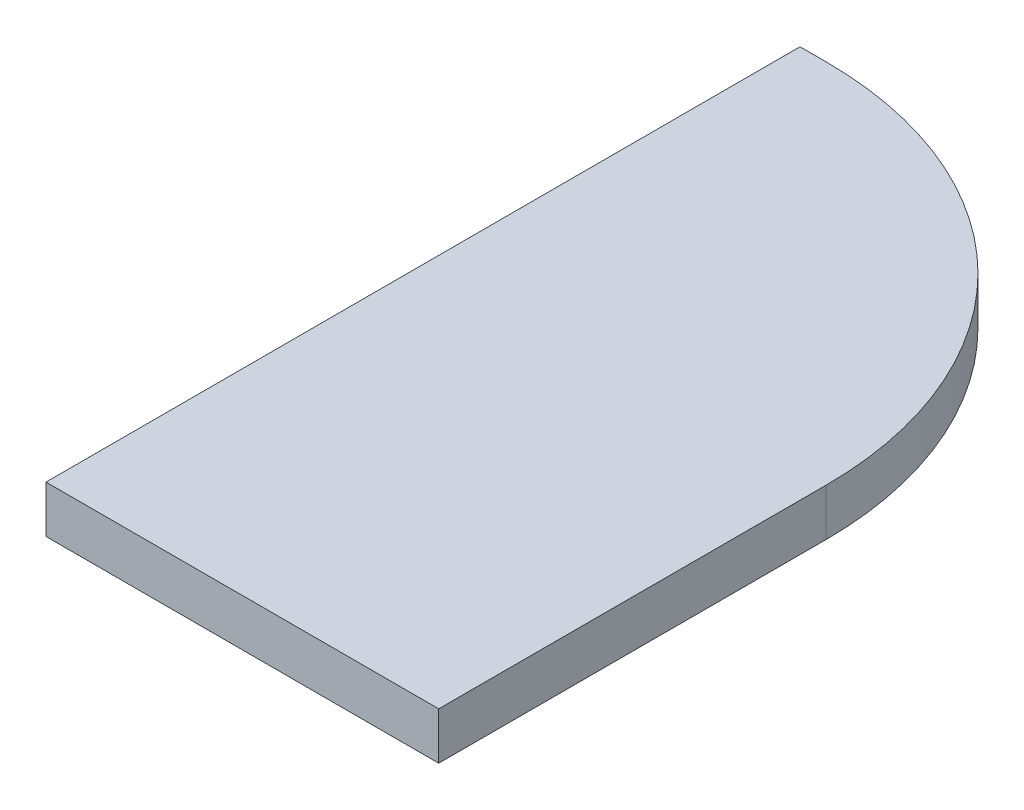
ISO-10303-21;
HEADER;
FILE_DESCRIPTION(('STEP AP214'),'2;1');
FILE_NAME('part.step','',(''),(''),'','','');
FILE_SCHEMA(('AUTOMOTIVE_DESIGN { 1 0 10303 214 1 1 1 1 }'));
ENDSEC;
DATA;
#1=APPLICATION_CONTEXT('core data for automotive mechanical design processes');
#2=APPLICATION_PROTOCOL_DEFINITION('international standard','automotive_design',2000,#1);
#3=PRODUCT_CONTEXT('',#1,'mechanical');
#4=PRODUCT('Part','Part','',(#3));
#5=PRODUCT_RELATED_PRODUCT_CATEGORY('part','',(#4));
#6=PRODUCT_DEFINITION_FORMATION('','',#4);
#7=PRODUCT_DEFINITION_CONTEXT('part definition',#1,'design');
#8=PRODUCT_DEFINITION('design','',#6,#7);
#9=PRODUCT_DEFINITION_SHAPE('','',#8);
#10=(LENGTH_UNIT() NAMED_UNIT(*) SI_UNIT(.MILLI.,.METRE.));
#11=(NAMED_UNIT(*) PLANE_ANGLE_UNIT() SI_UNIT($,.RADIAN.));
#12=(NAMED_UNIT(*) SI_UNIT($,.STERADIAN.) SOLID_ANGLE_UNIT());
#13=UNCERTAINTY_MEASURE_WITH_UNIT(LENGTH_MEASURE(1.E-05),#10,'distance_accuracy_value','');
#14=(GEOMETRIC_REPRESENTATION_CONTEXT(3) GLOBAL_UNCERTAINTY_ASSIGNED_CONTEXT((#13)) GLOBAL_UNIT_ASSIGNED_CONTEXT((#10,
#11,#12)) REPRESENTATION_CONTEXT('',''));
#15=CARTESIAN_POINT('',(0.,0.,0.));
#16=DIRECTION('',(0.,0.,1.));
#17=DIRECTION('',(1.,0.,0.));
#18=AXIS2_PLACEMENT_3D('',#15,#16,#17);
#19=CARTESIAN_POINT('',(-75.,18.,144.));
#20=DIRECTION('',(1.,0.,0.));
#21=DIRECTION('',(0.,0.,-1.));
#22=AXIS2_PLACEMENT_3D('',#19,#20,#21);
#23=PLANE('',#22);
#24=DIRECTION('',(0.,0.,1.));
#25=VECTOR('',#24,1.);
#26=CARTESIAN_POINT('',(-75.,0.,144.));
#27=LINE('',#26,#25);
#28=CARTESIAN_POINT('',(-75.,0.,-144.));
#29=VERTEX_POINT('',#28);
#30=CARTESIAN_POINT('',(-75.,0.,144.));
#31=VERTEX_POINT('',#30);
#32=EDGE_CURVE('E107',#29,#31,#27,.T.);
#33=ORIENTED_EDGE('',*,*,#32,.T.);
#34=DIRECTION('',(0.,-1.,0.));
#35=VECTOR('',#34,1.);
#36=CARTESIAN_POINT('',(-75.,18.,144.));
#37=LINE('',#36,#35);
#38=CARTESIAN_POINT('',(-75.,18.,144.));
#39=VERTEX_POINT('',#38);
#40=EDGE_CURVE('E11',#39,#31,#37,.T.);
#41=ORIENTED_EDGE('',*,*,#40,.F.);
#42=DIRECTION('',(0.,0.,1.));
#43=VECTOR('',#42,1.);
#44=CARTESIAN_POINT('',(-75.,18.,144.));
#45=LINE('',#44,#43);
#46=CARTESIAN_POINT('',(-75.,18.,-144.));
#47=VERTEX_POINT('',#46);
#48=EDGE_CURVE('E115',#47,#39,#45,.T.);
#49=ORIENTED_EDGE('',*,*,#48,.F.);
#50=DIRECTION('',(0.,-1.,0.));
#51=VECTOR('',#50,1.);
#52=CARTESIAN_POINT('',(-75.,18.,-144.));
#53=LINE('',#52,#51);
#54=EDGE_CURVE('E103',#47,#29,#53,.T.);
#55=ORIENTED_EDGE('',*,*,#54,.T.);
#56=EDGE_LOOP('',(#33,#41,#49,#55));
#57=FACE_BOUND('',#56,.T.);
#58=ADVANCED_FACE('F33',(#57),#23,.F.);
#59=CARTESIAN_POINT('',(75.,18.,144.));
#60=DIRECTION('',(0.,0.,-1.));
#61=DIRECTION('',(-1.,0.,0.));
#62=AXIS2_PLACEMENT_3D('',#59,#60,#61);
#63=PLANE('',#62);
#64=DIRECTION('',(1.,0.,0.));
#65=VECTOR('',#64,1.);
#66=CARTESIAN_POINT('',(75.,0.,144.));
#67=LINE('',#66,#65);
#68=CARTESIAN_POINT('',(75.,0.,144.));
#69=VERTEX_POINT('',#68);
#70=EDGE_CURVE('E110',#31,#69,#67,.T.);
#71=ORIENTED_EDGE('',*,*,#70,.T.);
#72=DIRECTION('',(0.,-1.,0.));
#73=VECTOR('',#72,1.);
#74=CARTESIAN_POINT('',(75.,18.,144.));
#75=LINE('',#74,#73);
#76=CARTESIAN_POINT('',(75.,18.,144.));
#77=VERTEX_POINT('',#76);
#78=EDGE_CURVE('E41',#77,#69,#75,.T.);
#79=ORIENTED_EDGE('',*,*,#78,.F.);
#80=DIRECTION('',(1.,0.,0.));
#81=VECTOR('',#80,1.);
#82=CARTESIAN_POINT('',(75.,18.,144.));
#83=LINE('',#82,#81);
#84=EDGE_CURVE('E83',#39,#77,#83,.T.);
#85=ORIENTED_EDGE('',*,*,#84,.F.);
#86=ORIENTED_EDGE('',*,*,#40,.T.);
#87=EDGE_LOOP('',(#71,#79,#85,#86));
#88=FACE_BOUND('',#87,.T.);
#89=ADVANCED_FACE('F134',(#88),#63,.F.);
#90=CARTESIAN_POINT('',(75.,18.,144.));
#91=DIRECTION('',(-1.,0.,0.));
#92=DIRECTION('',(0.,0.,1.));
#93=AXIS2_PLACEMENT_3D('',#90,#91,#92);
#94=PLANE('',#93);
#95=DIRECTION('',(0.,0.,-1.));
#96=VECTOR('',#95,1.);
#97=CARTESIAN_POINT('',(75.,0.,144.));
#98=LINE('',#97,#96);
#99=CARTESIAN_POINT('',(75.,0.,-4.0000000000001));
#100=VERTEX_POINT('',#99);
#101=EDGE_CURVE('E98',#69,#100,#98,.T.);
#102=ORIENTED_EDGE('',*,*,#101,.T.);
#103=DIRECTION('',(0.,-1.,0.));
#104=VECTOR('',#103,1.);
#105=CARTESIAN_POINT('',(75.,18.,-4.0000000000001));
#106=LINE('',#105,#104);
#107=CARTESIAN_POINT('',(75.,18.,-4.0000000000001));
#108=VERTEX_POINT('',#107);
#109=EDGE_CURVE('E95',#108,#100,#106,.T.);
#110=ORIENTED_EDGE('',*,*,#109,.F.);
#111=DIRECTION('',(0.,0.,-1.));
#112=VECTOR('',#111,1.);
#113=CARTESIAN_POINT('',(75.,18.,144.));
#114=LINE('',#113,#112);
#115=EDGE_CURVE('E87',#77,#108,#114,.T.);
#116=ORIENTED_EDGE('',*,*,#115,.F.);
#117=ORIENTED_EDGE('',*,*,#78,.T.);
#118=EDGE_LOOP('',(#102,#110,#116,#117));
#119=FACE_BOUND('',#118,.T.);
#120=ADVANCED_FACE('F96',(#119),#94,.F.);
#121=CARTESIAN_POINT('',(-65.,18.,-4.00000000000009));
#122=DIRECTION('',(0.,-1.,0.));
#123=DIRECTION('',(0.,0.,-1.));
#124=AXIS2_PLACEMENT_3D('',#121,#122,#123);
#125=CYLINDRICAL_SURFACE('',#124,140.);
#126=CARTESIAN_POINT('',(-65.,0.,-4.00000000000009));
#127=DIRECTION('',(0.,1.,0.));
#128=DIRECTION('',(0.,0.,-1.));
#129=AXIS2_PLACEMENT_3D('',#126,#127,#128);
#130=CIRCLE('',#129,140.);
#131=CARTESIAN_POINT('',(-65.,0.,-144.));
#132=VERTEX_POINT('',#131);
#133=EDGE_CURVE('E69',#100,#132,#130,.T.);
#134=ORIENTED_EDGE('',*,*,#133,.T.);
#135=DIRECTION('',(0.,-1.,0.));
#136=VECTOR('',#135,1.);
#137=CARTESIAN_POINT('',(-65.,18.,-144.));
#138=LINE('',#137,#136);
#139=CARTESIAN_POINT('',(-65.,18.,-144.));
#140=VERTEX_POINT('',#139);
#141=EDGE_CURVE('E99',#140,#132,#138,.T.);
#142=ORIENTED_EDGE('',*,*,#141,.F.);
#143=CARTESIAN_POINT('',(-65.,18.,-4.00000000000009));
#144=DIRECTION('',(0.,1.,0.));
#145=DIRECTION('',(0.,0.,-1.));
#146=AXIS2_PLACEMENT_3D('',#143,#144,#145);
#147=CIRCLE('',#146,140.);
#148=EDGE_CURVE('E91',#108,#140,#147,.T.);
#149=ORIENTED_EDGE('',*,*,#148,.F.);
#150=ORIENTED_EDGE('',*,*,#109,.T.);
#151=EDGE_LOOP('',(#134,#142,#149,#150));
#152=FACE_BOUND('',#151,.T.);
#153=ADVANCED_FACE('F101',(#152),#125,.T.);
#154=CARTESIAN_POINT('',(-65.,18.,-144.));
#155=DIRECTION('',(0.,0.,1.));
#156=DIRECTION('',(1.,0.,0.));
#157=AXIS2_PLACEMENT_3D('',#154,#155,#156);
#158=PLANE('',#157);
#159=DIRECTION('',(-1.,0.,0.));
#160=VECTOR('',#159,1.);
#161=CARTESIAN_POINT('',(-65.,0.,-144.));
#162=LINE('',#161,#160);
#163=EDGE_CURVE('E75',#132,#29,#162,.T.);
#164=ORIENTED_EDGE('',*,*,#163,.T.);
#165=ORIENTED_EDGE('',*,*,#54,.F.);
#166=DIRECTION('',(-1.,0.,0.));
#167=VECTOR('',#166,1.);
#168=CARTESIAN_POINT('',(-65.,18.,-144.));
#169=LINE('',#168,#167);
#170=EDGE_CURVE('E49',#140,#47,#169,.T.);
#171=ORIENTED_EDGE('',*,*,#170,.F.);
#172=ORIENTED_EDGE('',*,*,#141,.T.);
#173=EDGE_LOOP('',(#164,#165,#171,#172));
#174=FACE_BOUND('',#173,.T.);
#175=ADVANCED_FACE('F123',(#174),#158,.F.);
#176=CARTESIAN_POINT('',(-65.,18.,-4.00000000000009));
#177=DIRECTION('',(0.,-1.,0.));
#178=DIRECTION('',(0.,0.,-1.));
#179=AXIS2_PLACEMENT_3D('',#176,#177,#178);
#180=PLANE('',#179);
#181=ORIENTED_EDGE('',*,*,#48,.T.);
#182=ORIENTED_EDGE('',*,*,#84,.T.);
#183=ORIENTED_EDGE('',*,*,#115,.T.);
#184=ORIENTED_EDGE('',*,*,#148,.T.);
#185=ORIENTED_EDGE('',*,*,#170,.T.);
#186=EDGE_LOOP('',(#181,#182,#183,#184,#185));
#187=FACE_BOUND('',#186,.T.);
#188=ADVANCED_FACE('F89',(#187),#180,.F.);
#189=CARTESIAN_POINT('',(-65.,0.,-4.00000000000009));
#190=DIRECTION('',(0.,-1.,0.));
#191=DIRECTION('',(0.,0.,-1.));
#192=AXIS2_PLACEMENT_3D('',#189,#190,#191);
#193=PLANE('',#192);
#194=ORIENTED_EDGE('',*,*,#32,.F.);
#195=ORIENTED_EDGE('',*,*,#163,.F.);
#196=ORIENTED_EDGE('',*,*,#133,.F.);
#197=ORIENTED_EDGE('',*,*,#101,.F.);
#198=ORIENTED_EDGE('',*,*,#70,.F.);
#199=EDGE_LOOP('',(#194,#195,#196,#197,#198));
#200=FACE_BOUND('',#199,.T.);
#201=ADVANCED_FACE('F119',(#200),#193,.T.);
#202=CLOSED_SHELL('',(#58,#89,#120,#153,#175,#188,#201));
#203=MANIFOLD_SOLID_BREP('B2',#202);
#204=ADVANCED_BREP_SHAPE_REPRESENTATION('',(#18,#203),#14);
#205=SHAPE_DEFINITION_REPRESENTATION(#9,#204);
ENDSEC;
END-ISO-10303-21;
